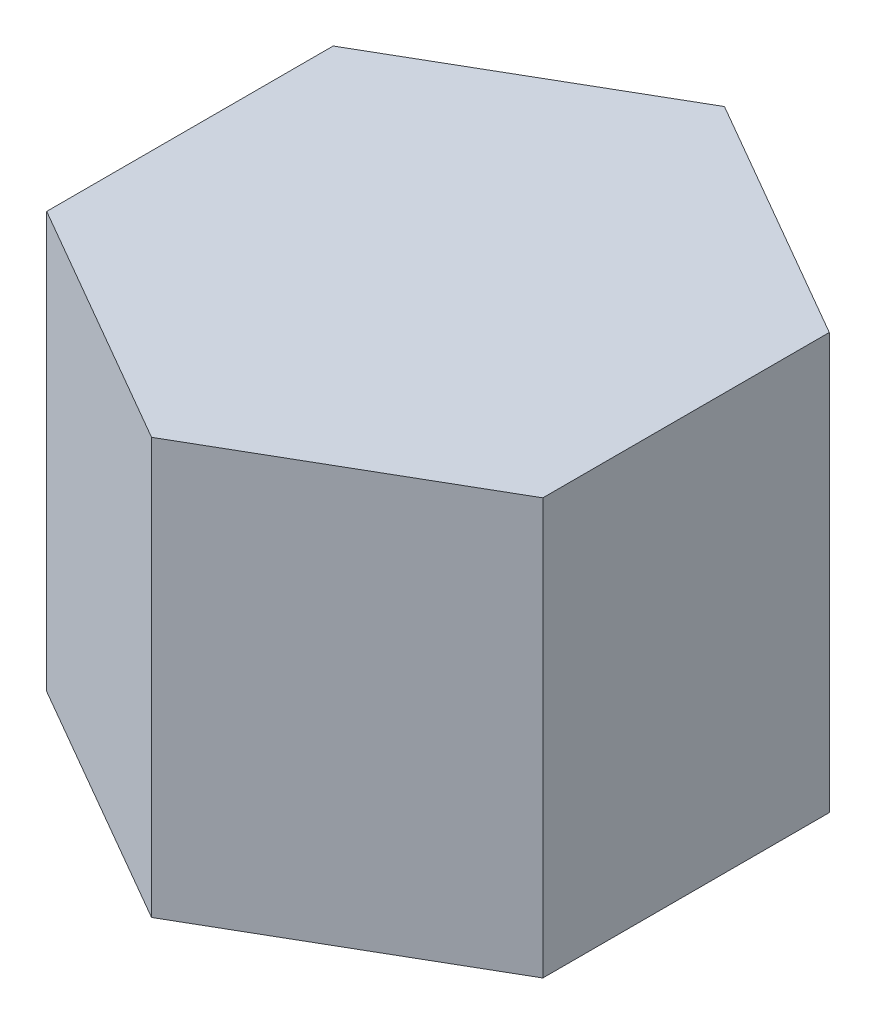
ISO-10303-21;
HEADER;
FILE_DESCRIPTION(('STEP AP214'),'2;1');
FILE_NAME('part.step','',(''),(''),'','','');
FILE_SCHEMA(('AUTOMOTIVE_DESIGN { 1 0 10303 214 1 1 1 1 }'));
ENDSEC;
DATA;
#1=APPLICATION_CONTEXT('core data for automotive mechanical design processes');
#2=APPLICATION_PROTOCOL_DEFINITION('international standard','automotive_design',2000,#1);
#3=PRODUCT_CONTEXT('',#1,'mechanical');
#4=PRODUCT('Part','Part','',(#3));
#5=PRODUCT_RELATED_PRODUCT_CATEGORY('part','',(#4));
#6=PRODUCT_DEFINITION_FORMATION('','',#4);
#7=PRODUCT_DEFINITION_CONTEXT('part definition',#1,'design');
#8=PRODUCT_DEFINITION('design','',#6,#7);
#9=PRODUCT_DEFINITION_SHAPE('','',#8);
#10=(LENGTH_UNIT() NAMED_UNIT(*) SI_UNIT(.MILLI.,.METRE.));
#11=(NAMED_UNIT(*) PLANE_ANGLE_UNIT() SI_UNIT($,.RADIAN.));
#12=(NAMED_UNIT(*) SI_UNIT($,.STERADIAN.) SOLID_ANGLE_UNIT());
#13=UNCERTAINTY_MEASURE_WITH_UNIT(LENGTH_MEASURE(1.E-05),#10,'distance_accuracy_value','');
#14=(GEOMETRIC_REPRESENTATION_CONTEXT(3) GLOBAL_UNCERTAINTY_ASSIGNED_CONTEXT((#13)) GLOBAL_UNIT_ASSIGNED_CONTEXT((#10,
#11,#12)) REPRESENTATION_CONTEXT('',''));
#15=CARTESIAN_POINT('',(0.,0.,0.));
#16=DIRECTION('',(0.,0.,1.));
#17=DIRECTION('',(1.,0.,0.));
#18=AXIS2_PLACEMENT_3D('',#15,#16,#17);
#19=CARTESIAN_POINT('',(204.642660308706,-148.537700895744,291.506971220494));
#20=DIRECTION('',(-0.499999999999909,0.,-0.866025403784491));
#21=DIRECTION('',(-0.866025403784491,0.,0.499999999999909));
#22=AXIS2_PLACEMENT_3D('',#19,#20,#21);
#23=PLANE('',#22);
#24=CARTESIAN_POINT('',(204.339551417382,-149.045793579175,291.681971220494));
#25=DIRECTION('',(0.866025403784491,0.,-0.499999999999909));
#26=VECTOR('',#25,1.);
#27=LINE('',#24,#26);
#28=CARTESIAN_POINT('',(204.339551417382,-149.045793579175,291.681971220494));
#29=VERTEX_POINT('',#28);
#30=CARTESIAN_POINT('',(204.642660308706,-149.045793579175,291.506971220494));
#31=VERTEX_POINT('',#30);
#32=EDGE_CURVE('E170',#29,#31,#27,.T.);
#33=ORIENTED_EDGE('',*,*,#32,.T.);
#34=CARTESIAN_POINT('',(204.642660308706,-148.537700895744,291.506971220494));
#35=DIRECTION('',(0.,-1.,0.));
#36=VECTOR('',#35,1.);
#37=LINE('',#34,#36);
#38=CARTESIAN_POINT('',(204.642660308706,-148.537700895744,291.506971220494));
#39=VERTEX_POINT('',#38);
#40=EDGE_CURVE('E35',#39,#31,#37,.T.);
#41=ORIENTED_EDGE('',*,*,#40,.F.);
#42=CARTESIAN_POINT('',(204.339551417382,-148.537700895744,291.681971220494));
#43=DIRECTION('',(0.866025403784491,0.,-0.499999999999909));
#44=VECTOR('',#43,1.);
#45=LINE('',#42,#44);
#46=CARTESIAN_POINT('',(204.339551417382,-148.537700895744,291.681971220494));
#47=VERTEX_POINT('',#46);
#48=EDGE_CURVE('E159',#47,#39,#45,.T.);
#49=ORIENTED_EDGE('',*,*,#48,.F.);
#50=CARTESIAN_POINT('',(204.339551417382,-148.537700895744,291.681971220494));
#51=DIRECTION('',(0.,-1.,0.));
#52=VECTOR('',#51,1.);
#53=LINE('',#50,#52);
#54=EDGE_CURVE('E10',#47,#29,#53,.T.);
#55=ORIENTED_EDGE('',*,*,#54,.T.);
#56=EDGE_LOOP('',(#33,#41,#49,#55));
#57=FACE_BOUND('',#56,.T.);
#58=ADVANCED_FACE('F16',(#57),#23,.F.);
#59=CARTESIAN_POINT('',(204.339551417382,-148.537700895744,291.681971220494));
#60=DIRECTION('',(0.500000000000062,0.,-0.866025403784403));
#61=DIRECTION('',(-0.866025403784403,0.,-0.500000000000062));
#62=AXIS2_PLACEMENT_3D('',#59,#60,#61);
#63=PLANE('',#62);
#64=CARTESIAN_POINT('',(204.036442526057,-149.045793579175,291.506971220494));
#65=DIRECTION('',(0.866025403784403,0.,0.500000000000062));
#66=VECTOR('',#65,1.);
#67=LINE('',#64,#66);
#68=CARTESIAN_POINT('',(204.036442526057,-149.045793579175,291.506971220494));
#69=VERTEX_POINT('',#68);
#70=EDGE_CURVE('E167',#69,#29,#67,.T.);
#71=ORIENTED_EDGE('',*,*,#70,.T.);
#72=ORIENTED_EDGE('',*,*,#54,.F.);
#73=CARTESIAN_POINT('',(204.036442526057,-148.537700895744,291.506971220494));
#74=DIRECTION('',(0.866025403784403,0.,0.500000000000062));
#75=VECTOR('',#74,1.);
#76=LINE('',#73,#75);
#77=CARTESIAN_POINT('',(204.036442526057,-148.537700895744,291.506971220494));
#78=VERTEX_POINT('',#77);
#79=EDGE_CURVE('E156',#78,#47,#76,.T.);
#80=ORIENTED_EDGE('',*,*,#79,.F.);
#81=CARTESIAN_POINT('',(204.036442526057,-148.537700895744,291.506971220494));
#82=DIRECTION('',(0.,-1.,0.));
#83=VECTOR('',#82,1.);
#84=LINE('',#81,#83);
#85=EDGE_CURVE('E27',#78,#69,#84,.T.);
#86=ORIENTED_EDGE('',*,*,#85,.T.);
#87=EDGE_LOOP('',(#71,#72,#80,#86));
#88=FACE_BOUND('',#87,.T.);
#89=ADVANCED_FACE('F189',(#88),#63,.F.);
#90=CARTESIAN_POINT('',(204.036442526057,-148.537700895744,290.831971220494));
#91=DIRECTION('',(1.,0.,0.));
#92=DIRECTION('',(0.,1.,0.));
#93=AXIS2_PLACEMENT_3D('',#90,#91,#92);
#94=PLANE('',#93);
#95=CARTESIAN_POINT('',(204.036442526057,-149.045793579175,291.156971220494));
#96=DIRECTION('',(0.,0.,1.));
#97=VECTOR('',#96,1.);
#98=LINE('',#95,#97);
#99=CARTESIAN_POINT('',(204.036442526057,-149.045793579175,291.156971220494));
#100=VERTEX_POINT('',#99);
#101=EDGE_CURVE('E163',#100,#69,#98,.T.);
#102=ORIENTED_EDGE('',*,*,#101,.T.);
#103=ORIENTED_EDGE('',*,*,#85,.F.);
#104=CARTESIAN_POINT('',(204.036442526057,-148.537700895744,291.156971220494));
#105=DIRECTION('',(0.,0.,1.));
#106=VECTOR('',#105,1.);
#107=LINE('',#104,#106);
#108=CARTESIAN_POINT('',(204.036442526057,-148.537700895744,291.156971220494));
#109=VERTEX_POINT('',#108);
#110=EDGE_CURVE('E106',#109,#78,#107,.T.);
#111=ORIENTED_EDGE('',*,*,#110,.F.);
#112=CARTESIAN_POINT('',(204.036442526057,-148.537700895744,291.156971220494));
#113=DIRECTION('',(0.,-1.,0.));
#114=VECTOR('',#113,1.);
#115=LINE('',#112,#114);
#116=EDGE_CURVE('E94',#109,#100,#115,.T.);
#117=ORIENTED_EDGE('',*,*,#116,.T.);
#118=EDGE_LOOP('',(#102,#103,#111,#117));
#119=FACE_BOUND('',#118,.T.);
#120=ADVANCED_FACE('F198',(#119),#94,.F.);
#121=CARTESIAN_POINT('',(204.036442526057,-148.537700895744,291.156971220494));
#122=DIRECTION('',(0.499999999999943,0.,0.866025403784472));
#123=DIRECTION('',(0.866025403784472,0.,-0.499999999999943));
#124=AXIS2_PLACEMENT_3D('',#121,#122,#123);
#125=PLANE('',#124);
#126=CARTESIAN_POINT('',(204.339551417382,-149.045793579175,290.981971220494));
#127=DIRECTION('',(-0.866025403784471,0.,0.499999999999943));
#128=VECTOR('',#127,1.);
#129=LINE('',#126,#128);
#130=CARTESIAN_POINT('',(204.339551417382,-149.045793579175,290.981971220494));
#131=VERTEX_POINT('',#130);
#132=EDGE_CURVE('E162',#131,#100,#129,.T.);
#133=ORIENTED_EDGE('',*,*,#132,.T.);
#134=ORIENTED_EDGE('',*,*,#116,.F.);
#135=CARTESIAN_POINT('',(204.339551417382,-148.537700895744,290.981971220494));
#136=DIRECTION('',(-0.866025403784471,0.,0.499999999999943));
#137=VECTOR('',#136,1.);
#138=LINE('',#135,#137);
#139=CARTESIAN_POINT('',(204.339551417382,-148.537700895744,290.981971220494));
#140=VERTEX_POINT('',#139);
#141=EDGE_CURVE('E98',#140,#109,#138,.T.);
#142=ORIENTED_EDGE('',*,*,#141,.F.);
#143=CARTESIAN_POINT('',(204.339551417382,-148.537700895744,290.981971220494));
#144=DIRECTION('',(0.,-1.,0.));
#145=VECTOR('',#144,1.);
#146=LINE('',#143,#145);
#147=EDGE_CURVE('E79',#140,#131,#146,.T.);
#148=ORIENTED_EDGE('',*,*,#147,.T.);
#149=EDGE_LOOP('',(#133,#134,#142,#148));
#150=FACE_BOUND('',#149,.T.);
#151=ADVANCED_FACE('F100',(#150),#125,.F.);
#152=CARTESIAN_POINT('',(204.339551417381,-148.537700895744,290.981971220494));
#153=DIRECTION('',(-0.500000000000062,0.,0.866025403784403));
#154=DIRECTION('',(0.866025403784403,0.,0.500000000000062));
#155=AXIS2_PLACEMENT_3D('',#152,#153,#154);
#156=PLANE('',#155);
#157=CARTESIAN_POINT('',(204.642660308706,-149.045793579175,291.156971220494));
#158=DIRECTION('',(-0.866025403784403,0.,-0.500000000000062));
#159=VECTOR('',#158,1.);
#160=LINE('',#157,#159);
#161=CARTESIAN_POINT('',(204.642660308706,-149.045793579175,291.156971220494));
#162=VERTEX_POINT('',#161);
#163=EDGE_CURVE('E88',#162,#131,#160,.T.);
#164=ORIENTED_EDGE('',*,*,#163,.T.);
#165=ORIENTED_EDGE('',*,*,#147,.F.);
#166=CARTESIAN_POINT('',(204.642660308706,-148.537700895744,291.156971220494));
#167=DIRECTION('',(-0.866025403784403,0.,-0.500000000000062));
#168=VECTOR('',#167,1.);
#169=LINE('',#166,#168);
#170=CARTESIAN_POINT('',(204.642660308706,-148.537700895744,291.156971220494));
#171=VERTEX_POINT('',#170);
#172=EDGE_CURVE('E84',#171,#140,#169,.T.);
#173=ORIENTED_EDGE('',*,*,#172,.F.);
#174=CARTESIAN_POINT('',(204.642660308706,-148.537700895744,291.156971220494));
#175=DIRECTION('',(0.,-1.,0.));
#176=VECTOR('',#175,1.);
#177=LINE('',#174,#176);
#178=EDGE_CURVE('E58',#171,#162,#177,.T.);
#179=ORIENTED_EDGE('',*,*,#178,.T.);
#180=EDGE_LOOP('',(#164,#165,#173,#179));
#181=FACE_BOUND('',#180,.T.);
#182=ADVANCED_FACE('F82',(#181),#156,.F.);
#183=CARTESIAN_POINT('',(204.642660308706,-148.537700895744,290.831971220494));
#184=DIRECTION('',(-1.,0.,0.));
#185=DIRECTION('',(0.,-1.,0.));
#186=AXIS2_PLACEMENT_3D('',#183,#184,#185);
#187=PLANE('',#186);
#188=CARTESIAN_POINT('',(204.642660308706,-149.045793579175,291.506971220494));
#189=DIRECTION('',(0.,0.,-1.));
#190=VECTOR('',#189,1.);
#191=LINE('',#188,#190);
#192=EDGE_CURVE('E160',#31,#162,#191,.T.);
#193=ORIENTED_EDGE('',*,*,#192,.T.);
#194=ORIENTED_EDGE('',*,*,#178,.F.);
#195=CARTESIAN_POINT('',(204.642660308706,-148.537700895744,291.506971220494));
#196=DIRECTION('',(0.,0.,-1.));
#197=VECTOR('',#196,1.);
#198=LINE('',#195,#197);
#199=EDGE_CURVE('E112',#39,#171,#198,.T.);
#200=ORIENTED_EDGE('',*,*,#199,.F.);
#201=ORIENTED_EDGE('',*,*,#40,.T.);
#202=EDGE_LOOP('',(#193,#194,#200,#201));
#203=FACE_BOUND('',#202,.T.);
#204=ADVANCED_FACE('F131',(#203),#187,.F.);
#205=CARTESIAN_POINT('',(206.339551417382,-148.537700895744,290.831971220494));
#206=DIRECTION('',(0.,-1.,0.));
#207=DIRECTION('',(1.,0.,0.));
#208=AXIS2_PLACEMENT_3D('',#205,#206,#207);
#209=PLANE('',#208);
#210=ORIENTED_EDGE('',*,*,#48,.T.);
#211=ORIENTED_EDGE('',*,*,#199,.T.);
#212=ORIENTED_EDGE('',*,*,#172,.T.);
#213=ORIENTED_EDGE('',*,*,#141,.T.);
#214=ORIENTED_EDGE('',*,*,#110,.T.);
#215=ORIENTED_EDGE('',*,*,#79,.T.);
#216=EDGE_LOOP('',(#210,#211,#212,#213,#214,#215));
#217=FACE_BOUND('',#216,.T.);
#218=ADVANCED_FACE('F111',(#217),#209,.F.);
#219=CARTESIAN_POINT('',(206.339551417382,-149.045793579175,290.831971220494));
#220=DIRECTION('',(0.,-1.,0.));
#221=DIRECTION('',(1.,0.,0.));
#222=AXIS2_PLACEMENT_3D('',#219,#220,#221);
#223=PLANE('',#222);
#224=ORIENTED_EDGE('',*,*,#32,.F.);
#225=ORIENTED_EDGE('',*,*,#70,.F.);
#226=ORIENTED_EDGE('',*,*,#101,.F.);
#227=ORIENTED_EDGE('',*,*,#132,.F.);
#228=ORIENTED_EDGE('',*,*,#163,.F.);
#229=ORIENTED_EDGE('',*,*,#192,.F.);
#230=EDGE_LOOP('',(#224,#225,#226,#227,#228,#229));
#231=FACE_BOUND('',#230,.T.);
#232=ADVANCED_FACE('F130',(#231),#223,.T.);
#233=CLOSED_SHELL('',(#58,#89,#120,#151,#182,#204,#218,#232));
#234=MANIFOLD_SOLID_BREP('B1',#233);
#235=ADVANCED_BREP_SHAPE_REPRESENTATION('',(#18,#234),#14);
#236=SHAPE_DEFINITION_REPRESENTATION(#9,#235);
ENDSEC;
END-ISO-10303-21;
